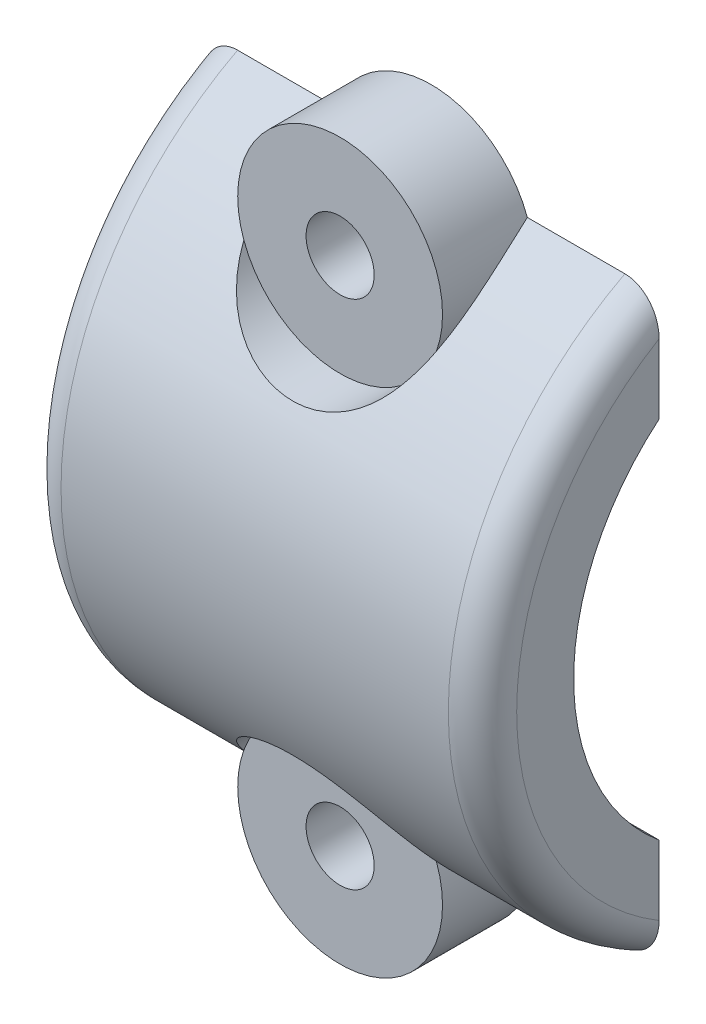
ISO-10303-21;
HEADER;
FILE_DESCRIPTION(('STEP AP214'),'2;1');
FILE_NAME('part.step','',(''),(''),'','','');
FILE_SCHEMA(('AUTOMOTIVE_DESIGN { 1 0 10303 214 1 1 1 1 }'));
ENDSEC;
DATA;
#1=APPLICATION_CONTEXT('core data for automotive mechanical design processes');
#2=APPLICATION_PROTOCOL_DEFINITION('international standard','automotive_design',2000,#1);
#3=PRODUCT_CONTEXT('',#1,'mechanical');
#4=PRODUCT('Part','Part','',(#3));
#5=PRODUCT_RELATED_PRODUCT_CATEGORY('part','',(#4));
#6=PRODUCT_DEFINITION_FORMATION('','',#4);
#7=PRODUCT_DEFINITION_CONTEXT('part definition',#1,'design');
#8=PRODUCT_DEFINITION('design','',#6,#7);
#9=PRODUCT_DEFINITION_SHAPE('','',#8);
#10=(LENGTH_UNIT() NAMED_UNIT(*) SI_UNIT(.MILLI.,.METRE.));
#11=(NAMED_UNIT(*) PLANE_ANGLE_UNIT() SI_UNIT($,.RADIAN.));
#12=(NAMED_UNIT(*) SI_UNIT($,.STERADIAN.) SOLID_ANGLE_UNIT());
#13=UNCERTAINTY_MEASURE_WITH_UNIT(LENGTH_MEASURE(1.E-05),#10,'distance_accuracy_value','');
#14=(GEOMETRIC_REPRESENTATION_CONTEXT(3) GLOBAL_UNCERTAINTY_ASSIGNED_CONTEXT((#13)) GLOBAL_UNIT_ASSIGNED_CONTEXT((#10,
#11,#12)) REPRESENTATION_CONTEXT('',''));
#15=CARTESIAN_POINT('',(0.,0.,0.));
#16=DIRECTION('',(0.,0.,1.));
#17=DIRECTION('',(1.,0.,0.));
#18=AXIS2_PLACEMENT_3D('',#15,#16,#17);
#19=CARTESIAN_POINT('',(35.8196875692033,0.,0.));
#20=DIRECTION('',(0.,0.,1.));
#21=DIRECTION('',(1.,0.,0.));
#22=AXIS2_PLACEMENT_3D('',#19,#20,#21);
#23=PLANE('',#22);
#24=CARTESIAN_POINT('',(-10.7949999999999,55.2907453999999,0.));
#25=DIRECTION('',(0.,0.,1.));
#26=DIRECTION('',(1.,0.,0.));
#27=AXIS2_PLACEMENT_3D('',#24,#25,#26);
#28=CIRCLE('',#27,1.89865);
#29=CARTESIAN_POINT('',(-8.89634999999989,55.2907453999999,0.));
#30=VERTEX_POINT('',#29);
#31=EDGE_CURVE('E191',#30,#30,#28,.T.);
#32=ORIENTED_EDGE('',*,*,#31,.T.);
#33=EDGE_LOOP('',(#32));
#34=FACE_BOUND('',#33,.T.);
#35=DIRECTION('',(-1.,0.,0.));
#36=VECTOR('',#35,1.);
#37=CARTESIAN_POINT('',(35.8196875692033,57.262527765294,0.));
#38=LINE('',#37,#36);
#39=CARTESIAN_POINT('',(1.04083408558608E-13,57.262527765294,0.));
#40=VERTEX_POINT('',#39);
#41=CARTESIAN_POINT('',(-5.43769105553762,57.262527765294,0.));
#42=VERTEX_POINT('',#41);
#43=EDGE_CURVE('E218',#40,#42,#38,.T.);
#44=ORIENTED_EDGE('',*,*,#43,.F.);
#45=CARTESIAN_POINT('',(0.,57.262527765294,0.));
#46=CARTESIAN_POINT('',(0.0490933325175248,57.2625361729945,0.));
#47=CARTESIAN_POINT('',(0.0981825549839693,57.2603879957028,0.));
#48=CARTESIAN_POINT('',(0.195977393935503,57.2518429280401,0.));
#49=CARTESIAN_POINT('',(0.244683106863623,57.2454471427635,0.));
#50=CARTESIAN_POINT('',(0.341190293861829,57.2285013083362,0.));
#51=CARTESIAN_POINT('',(0.388994359023456,57.2179660487811,0.));
#52=CARTESIAN_POINT('',(0.48352208379878,57.1928725873831,0.));
#53=CARTESIAN_POINT('',(0.530245712738035,57.1783142714739,0.));
#54=CARTESIAN_POINT('',(0.668258514115837,57.1288438188393,0.));
#55=CARTESIAN_POINT('',(0.75753119172517,57.0881108470386,0.));
#56=CARTESIAN_POINT('',(0.928324745462773,56.9928183852246,0.));
#57=CARTESIAN_POINT('',(1.00984066361444,56.9382501325223,0.));
#58=CARTESIAN_POINT('',(1.16668017679153,56.8147726046423,0.));
#59=CARTESIAN_POINT('',(1.24161160851703,56.745366120251,0.));
#60=CARTESIAN_POINT('',(1.38009979039235,56.596066634906,0.));
#61=CARTESIAN_POINT('',(1.44365503002219,56.5161722438155,0.));
#62=CARTESIAN_POINT('',(1.56484021102702,56.339198250084,0.));
#63=CARTESIAN_POINT('',(1.62111875817446,56.2411946090151,0.));
#64=CARTESIAN_POINT('',(1.71855597008335,56.0378532028676,0.));
#65=CARTESIAN_POINT('',(1.75969496105834,55.9325061048433,0.));
#66=CARTESIAN_POINT('',(1.8307416114643,55.7042443580008,0.));
#67=CARTESIAN_POINT('',(1.85872466975665,55.580732961841,0.));
#68=CARTESIAN_POINT('',(1.89584377405495,55.3312173101929,0.));
#69=CARTESIAN_POINT('',(1.90502816271561,55.2052202922972,0.));
#70=CARTESIAN_POINT('',(1.90500000000009,55.0793618565784,0.));
#71=B_SPLINE_CURVE_WITH_KNOTS('',3,(#45,#46,#47,#48,#49,#50,#51,#52,#53,#54,#55,#56,#57,#58,#59,
#60,#61,#62,#63,#64,#65,#66,#67,#68,#69,#70),.UNSPECIFIED.,.F.,.F.,(4,2,2,2,2,2,2,2,2,2,2,2,4),
(0.,0.147226065248074,0.294413841889357,0.441080456312521,0.587751229617397,0.880666747318197,
1.17376825094267,1.47891534691114,1.7841029300143,2.1217850014259,2.45990435249988,
2.83834837694025,3.21581796582278),.UNSPECIFIED.);
#72=CARTESIAN_POINT('',(1.9050000000001,55.0793618565784,0.));
#73=VERTEX_POINT('',#72);
#74=EDGE_CURVE('E273',#40,#73,#71,.T.);
#75=ORIENTED_EDGE('',*,*,#74,.T.);
#76=DIRECTION('',(0.,-1.,0.));
#77=VECTOR('',#76,1.);
#78=CARTESIAN_POINT('',(1.90500000000011,0.,0.));
#79=LINE('',#78,#77);
#80=CARTESIAN_POINT('',(1.90500000000011,51.1949953999999,0.));
#81=VERTEX_POINT('',#80);
#82=EDGE_CURVE('E201',#73,#81,#79,.T.);
#83=ORIENTED_EDGE('',*,*,#82,.T.);
#84=DIRECTION('',(-1.,0.,0.));
#85=VECTOR('',#84,1.);
#86=CARTESIAN_POINT('',(35.8196875692033,51.1949953999999,0.));
#87=LINE('',#86,#85);
#88=CARTESIAN_POINT('',(-23.4949999999999,51.1949953999999,0.));
#89=VERTEX_POINT('',#88);
#90=EDGE_CURVE('E216',#81,#89,#87,.T.);
#91=ORIENTED_EDGE('',*,*,#90,.T.);
#92=DIRECTION('',(0.,1.,0.));
#93=VECTOR('',#92,1.);
#94=CARTESIAN_POINT('',(-23.4949999999999,0.,0.));
#95=LINE('',#94,#93);
#96=CARTESIAN_POINT('',(-23.4949999999999,55.0793618565784,0.));
#97=VERTEX_POINT('',#96);
#98=EDGE_CURVE('E196',#89,#97,#95,.T.);
#99=ORIENTED_EDGE('',*,*,#98,.T.);
#100=CARTESIAN_POINT('',(-23.4949999999999,55.0793618565784,0.));
#101=CARTESIAN_POINT('',(-23.4949861644648,55.1604772184922,0.));
#102=CARTESIAN_POINT('',(-23.4911935120087,55.2415428752054,0.));
#103=CARTESIAN_POINT('',(-23.4758993564817,55.4030230016933,0.));
#104=CARTESIAN_POINT('',(-23.4643900787791,55.483436731861,0.));
#105=CARTESIAN_POINT('',(-23.4179045735488,55.7234850875497,0.));
#106=CARTESIAN_POINT('',(-23.3709671738861,55.8810362336567,0.));
#107=CARTESIAN_POINT('',(-23.2540851999662,56.1611894101536,0.));
#108=CARTESIAN_POINT('',(-23.1883735777487,56.285572058831,0.));
#109=CARTESIAN_POINT('',(-23.0342107388053,56.5189428441837,0.));
#110=CARTESIAN_POINT('',(-22.9458423148961,56.6279848382293,0.));
#111=CARTESIAN_POINT('',(-22.7609682537806,56.8123805640701,0.));
#112=CARTESIAN_POINT('',(-22.6670153229301,56.8902712074076,0.));
#113=CARTESIAN_POINT('',(-22.5161948811248,56.9922345065611,0.));
#114=CARTESIAN_POINT('',(-22.4642535433482,57.0237516817825,0.));
#115=CARTESIAN_POINT('',(-22.3574771047742,57.081401166128,0.));
#116=CARTESIAN_POINT('',(-22.3026437501136,57.1075366788708,0.));
#117=CARTESIAN_POINT('',(-22.1948650223462,57.1522411313464,0.));
#118=CARTESIAN_POINT('',(-22.1420956218219,57.1712356902118,0.));
#119=CARTESIAN_POINT('',(-22.0349673128254,57.2040224484383,0.));
#120=CARTESIAN_POINT('',(-21.9806086281649,57.217815376555,0.));
#121=CARTESIAN_POINT('',(-21.8705084304921,57.2400491166256,0.));
#122=CARTESIAN_POINT('',(-21.8147611559611,57.2484614502685,0.));
#123=CARTESIAN_POINT('',(-21.7026780521917,57.2597099247138,0.));
#124=CARTESIAN_POINT('',(-21.6463419279188,57.2625431208493,0.));
#125=CARTESIAN_POINT('',(-21.5899999999999,57.262527765294,0.));
#126=B_SPLINE_CURVE_WITH_KNOTS('',3,(#100,#101,#102,#103,#104,#105,#106,#107,#108,#109,#110,
#111,#112,#113,#114,#115,#116,#117,#118,#119,#120,#121,#122,#123,#124,#125),.UNSPECIFIED.,.F.,
.F.,(4,2,2,2,2,2,2,2,2,2,2,2,4),(0.,0.243150095315534,0.486545537363687,0.975964841781668,
1.39562431400345,1.81377159016872,2.17754033950067,2.3595485588032,2.54144811625258,
2.70944622477471,2.87742078777977,3.04627720298761,3.21522271669345),.UNSPECIFIED.);
#127=CARTESIAN_POINT('',(-21.5899999999999,57.262527765294,0.));
#128=VERTEX_POINT('',#127);
#129=EDGE_CURVE('E279',#97,#128,#126,.T.);
#130=ORIENTED_EDGE('',*,*,#129,.T.);
#131=CARTESIAN_POINT('',(-16.1523089444621,57.262527765294,0.));
#132=VERTEX_POINT('',#131);
#133=EDGE_CURVE('E211',#132,#128,#38,.T.);
#134=ORIENTED_EDGE('',*,*,#133,.F.);
#135=CARTESIAN_POINT('',(-10.7949999999999,55.2907453999999,0.));
#136=DIRECTION('',(0.,0.,1.));
#137=DIRECTION('',(1.,0.,0.));
#138=AXIS2_PLACEMENT_3D('',#135,#136,#137);
#139=CIRCLE('',#138,5.70865);
#140=EDGE_CURVE('E187',#42,#132,#139,.T.);
#141=ORIENTED_EDGE('',*,*,#140,.F.);
#142=EDGE_LOOP('',(#44,#75,#83,#91,#99,#130,#134,#141));
#143=FACE_BOUND('',#142,.T.);
#144=ADVANCED_FACE('F35',(#34,#143),#23,.F.);
#145=CARTESIAN_POINT('',(35.8196875692033,0.,0.));
#146=DIRECTION('',(0.,0.,-1.));
#147=DIRECTION('',(-1.,0.,0.));
#148=AXIS2_PLACEMENT_3D('',#145,#146,#147);
#149=PLANE('',#148);
#150=CARTESIAN_POINT('',(-10.7949999999999,26.7792453999999,0.));
#151=DIRECTION('',(0.,0.,-1.));
#152=DIRECTION('',(-1.,0.,0.));
#153=AXIS2_PLACEMENT_3D('',#150,#151,#152);
#154=CIRCLE('',#153,1.89865);
#155=CARTESIAN_POINT('',(-12.6936499999999,26.7792453999999,0.));
#156=VERTEX_POINT('',#155);
#157=EDGE_CURVE('E143',#156,#156,#154,.F.);
#158=ORIENTED_EDGE('',*,*,#157,.T.);
#159=EDGE_LOOP('',(#158));
#160=FACE_BOUND('',#159,.T.);
#161=DIRECTION('',(0.,1.,0.));
#162=VECTOR('',#161,1.);
#163=CARTESIAN_POINT('',(1.90500000000011,0.,0.));
#164=LINE('',#163,#162);
#165=CARTESIAN_POINT('',(1.90500000000011,26.9906289434214,0.));
#166=VERTEX_POINT('',#165);
#167=CARTESIAN_POINT('',(1.9050000000001,30.8749953999999,0.));
#168=VERTEX_POINT('',#167);
#169=EDGE_CURVE('E200',#166,#168,#164,.T.);
#170=ORIENTED_EDGE('',*,*,#169,.F.);
#171=CARTESIAN_POINT('',(1.9050000000001,26.9906289434214,0.));
#172=CARTESIAN_POINT('',(1.90498616446498,26.9095135815077,0.));
#173=CARTESIAN_POINT('',(1.90119351200893,26.8284479247944,0.));
#174=CARTESIAN_POINT('',(1.88589935648186,26.6669677983066,0.));
#175=CARTESIAN_POINT('',(1.87439007877933,26.5865540681388,0.));
#176=CARTESIAN_POINT('',(1.82790457354895,26.3465057124501,0.));
#177=CARTESIAN_POINT('',(1.7809671738863,26.1889545663432,0.));
#178=CARTESIAN_POINT('',(1.6640851999664,25.9088013898462,0.));
#179=CARTESIAN_POINT('',(1.59837357774884,25.7844187411689,0.));
#180=CARTESIAN_POINT('',(1.44421073880548,25.5510479558161,0.));
#181=CARTESIAN_POINT('',(1.35584231489629,25.4420059617705,0.));
#182=CARTESIAN_POINT('',(1.17096825378082,25.2576102359297,0.));
#183=CARTESIAN_POINT('',(1.07701532293032,25.1797195925923,0.));
#184=CARTESIAN_POINT('',(0.926194881124996,25.0777562934388,0.));
#185=CARTESIAN_POINT('',(0.874253543348375,25.0462391182174,0.));
#186=CARTESIAN_POINT('',(0.767477104774417,24.9885896338718,0.));
#187=CARTESIAN_POINT('',(0.712643750113809,24.962454121129,0.));
#188=CARTESIAN_POINT('',(0.604865022346436,24.9177496686535,0.));
#189=CARTESIAN_POINT('',(0.552095621822044,24.8987551097881,0.));
#190=CARTESIAN_POINT('',(0.44496731282555,24.8659683515616,0.));
#191=CARTESIAN_POINT('',(0.390608628165044,24.8521754234448,0.));
#192=CARTESIAN_POINT('',(0.280508430492258,24.8299416833742,0.));
#193=CARTESIAN_POINT('',(0.224761155961284,24.8215293497314,0.));
#194=CARTESIAN_POINT('',(0.112678052191859,24.8102808752861,0.));
#195=CARTESIAN_POINT('',(0.0563419279189433,24.8074476791505,0.));
#196=CARTESIAN_POINT('',(0.,24.8074630347058,0.));
#197=B_SPLINE_CURVE_WITH_KNOTS('',3,(#171,#172,#173,#174,#175,#176,#177,#178,#179,#180,#181,
#182,#183,#184,#185,#186,#187,#188,#189,#190,#191,#192,#193,#194,#195,#196),.UNSPECIFIED.,.F.,
.F.,(4,2,2,2,2,2,2,2,2,2,2,2,4),(0.,0.243150095315531,0.48654553736369,0.975964841781664,
1.39562431400345,1.81377159016872,2.17754033950067,2.35954855880319,2.54144811625258,
2.70944622477471,2.87742078777977,3.04627720298761,3.21522271669345),.UNSPECIFIED.);
#198=CARTESIAN_POINT('',(1.11022302462516E-13,24.8074630347058,0.));
#199=VERTEX_POINT('',#198);
#200=EDGE_CURVE('E44',#166,#199,#197,.T.);
#201=ORIENTED_EDGE('',*,*,#200,.T.);
#202=DIRECTION('',(-1.,0.,0.));
#203=VECTOR('',#202,1.);
#204=CARTESIAN_POINT('',(35.8196875692033,24.8074630347059,0.));
#205=LINE('',#204,#203);
#206=CARTESIAN_POINT('',(-5.43769105553762,24.8074630347058,0.));
#207=VERTEX_POINT('',#206);
#208=EDGE_CURVE('E212',#199,#207,#205,.T.);
#209=ORIENTED_EDGE('',*,*,#208,.T.);
#210=CARTESIAN_POINT('',(-10.7949999999999,26.7792453999999,0.));
#211=DIRECTION('',(0.,0.,-1.));
#212=DIRECTION('',(1.,0.,0.));
#213=AXIS2_PLACEMENT_3D('',#210,#211,#212);
#214=CIRCLE('',#213,5.70865);
#215=CARTESIAN_POINT('',(-16.1523089444621,24.8074630347058,0.));
#216=VERTEX_POINT('',#215);
#217=EDGE_CURVE('E136',#207,#216,#214,.T.);
#218=ORIENTED_EDGE('',*,*,#217,.T.);
#219=CARTESIAN_POINT('',(-21.5899999999999,24.8074630347058,0.));
#220=VERTEX_POINT('',#219);
#221=EDGE_CURVE('E141',#216,#220,#205,.T.);
#222=ORIENTED_EDGE('',*,*,#221,.T.);
#223=CARTESIAN_POINT('',(-21.5899999999999,24.8074630347058,0.));
#224=CARTESIAN_POINT('',(-21.6390933325173,24.8074546270054,0.));
#225=CARTESIAN_POINT('',(-21.6881825549838,24.8096028042971,0.));
#226=CARTESIAN_POINT('',(-21.7859773939353,24.8181478719597,0.));
#227=CARTESIAN_POINT('',(-21.8346831068634,24.8245436572363,0.));
#228=CARTESIAN_POINT('',(-21.9311902938616,24.8414894916637,0.));
#229=CARTESIAN_POINT('',(-21.9789943590233,24.8520247512187,0.));
#230=CARTESIAN_POINT('',(-22.0735220837986,24.8771182126168,0.));
#231=CARTESIAN_POINT('',(-22.1202457127379,24.8916765285259,0.));
#232=CARTESIAN_POINT('',(-22.2582585141156,24.9411469811605,0.));
#233=CARTESIAN_POINT('',(-22.347531191725,24.9818799529612,0.));
#234=CARTESIAN_POINT('',(-22.5183247454626,25.0771724147753,0.));
#235=CARTESIAN_POINT('',(-22.5998406636143,25.1317406674775,0.));
#236=CARTESIAN_POINT('',(-22.7566801767913,25.2552181953575,0.));
#237=CARTESIAN_POINT('',(-22.8316116085168,25.3246246797488,0.));
#238=CARTESIAN_POINT('',(-22.9700997903922,25.4739241650939,0.));
#239=CARTESIAN_POINT('',(-23.033655030022,25.5538185561844,0.));
#240=CARTESIAN_POINT('',(-23.1548402110268,25.7307925499159,0.));
#241=CARTESIAN_POINT('',(-23.2111187581743,25.8287961909847,0.));
#242=CARTESIAN_POINT('',(-23.3085559700832,26.0321375971322,0.));
#243=CARTESIAN_POINT('',(-23.3496949610582,26.1374846951565,0.));
#244=CARTESIAN_POINT('',(-23.4207416114641,26.3657464419991,0.));
#245=CARTESIAN_POINT('',(-23.4487246697565,26.4892578381589,0.));
#246=CARTESIAN_POINT('',(-23.4858437740548,26.738773489807,0.));
#247=CARTESIAN_POINT('',(-23.4950281627154,26.8647705077027,0.));
#248=CARTESIAN_POINT('',(-23.4949999999999,26.9906289434214,0.));
#249=B_SPLINE_CURVE_WITH_KNOTS('',3,(#223,#224,#225,#226,#227,#228,#229,#230,#231,#232,#233,
#234,#235,#236,#237,#238,#239,#240,#241,#242,#243,#244,#245,#246,#247,#248),.UNSPECIFIED.,.F.,
.F.,(4,2,2,2,2,2,2,2,2,2,2,2,4),(0.,0.147226065248073,0.294413841889356,0.441080456312521,
0.587751229617397,0.880666747318196,1.17376825094268,1.47891534691114,1.78410293001431,
2.12178500142591,2.45990435249989,2.83834837694026,3.21581796582278),.UNSPECIFIED.);
#250=CARTESIAN_POINT('',(-23.4949999999999,26.9906289434214,0.));
#251=VERTEX_POINT('',#250);
#252=EDGE_CURVE('E51',#220,#251,#249,.T.);
#253=ORIENTED_EDGE('',*,*,#252,.T.);
#254=DIRECTION('',(0.,-1.,0.));
#255=VECTOR('',#254,1.);
#256=CARTESIAN_POINT('',(-23.4949999999999,0.,0.));
#257=LINE('',#256,#255);
#258=CARTESIAN_POINT('',(-23.4949999999999,30.8749953999999,0.));
#259=VERTEX_POINT('',#258);
#260=EDGE_CURVE('E209',#259,#251,#257,.T.);
#261=ORIENTED_EDGE('',*,*,#260,.F.);
#262=DIRECTION('',(-1.,0.,0.));
#263=VECTOR('',#262,1.);
#264=CARTESIAN_POINT('',(35.8196875692033,30.8749953999999,0.));
#265=LINE('',#264,#263);
#266=EDGE_CURVE('E214',#168,#259,#265,.T.);
#267=ORIENTED_EDGE('',*,*,#266,.F.);
#268=EDGE_LOOP('',(#170,#201,#209,#218,#222,#253,#261,#267));
#269=FACE_BOUND('',#268,.T.);
#270=ADVANCED_FACE('F251',(#160,#269),#149,.T.);
#271=CARTESIAN_POINT('',(35.8196875692033,41.0349953999999,-8.45608333333334));
#272=DIRECTION('',(-1.,0.,0.));
#273=DIRECTION('',(0.,-1.,0.));
#274=AXIS2_PLACEMENT_3D('',#271,#272,#273);
#275=CYLINDRICAL_SURFACE('',#274,18.2985833333333);
#276=ORIENTED_EDGE('',*,*,#208,.F.);
#277=CARTESIAN_POINT('',(0.,41.0349953999999,-8.45608333333334));
#278=DIRECTION('',(-1.,0.,0.));
#279=DIRECTION('',(0.,-1.,0.));
#280=AXIS2_PLACEMENT_3D('',#277,#278,#279);
#281=CIRCLE('',#280,18.2985833333333);
#282=EDGE_CURVE('E302',#199,#40,#281,.T.);
#283=ORIENTED_EDGE('',*,*,#282,.T.);
#284=ORIENTED_EDGE('',*,*,#43,.T.);
#285=CARTESIAN_POINT('',(-5.42705603913339,53.3481022378374,5.08));
#286=CARTESIAN_POINT('',(-5.39545530870201,53.4354259489317,5.0005689802008));
#287=CARTESIAN_POINT('',(-5.36636738368394,53.5224566313771,4.91985377745813));
#288=CARTESIAN_POINT('',(-5.3129700470884,53.6956754916432,4.75601438420526));
#289=CARTESIAN_POINT('',(-5.28865953873438,53.7818638585109,4.67289075165079));
#290=CARTESIAN_POINT('',(-5.22257690042593,54.0385567190107,4.42037020418626));
#291=CARTESIAN_POINT('',(-5.18755048950347,54.2074803456216,4.24755907668908));
#292=CARTESIAN_POINT('',(-5.13396234516217,54.5366362448042,3.89708244503129));
#293=CARTESIAN_POINT('',(-5.11513138388365,54.696967345291,3.71954902225021));
#294=CARTESIAN_POINT('',(-5.09103323485701,55.0110068137217,3.35775041373031));
#295=CARTESIAN_POINT('',(-5.0857712218314,55.1647126330487,3.17348268692457));
#296=CARTESIAN_POINT('',(-5.0871769788107,55.4999005560824,2.7551767137304));
#297=CARTESIAN_POINT('',(-5.0969311185005,55.6794454891102,2.51959887557127));
#298=CARTESIAN_POINT('',(-5.1312699527197,56.0264404336525,2.04068956522794));
#299=CARTESIAN_POINT('',(-5.15585997748074,56.1938860739145,1.79735533610562));
#300=CARTESIAN_POINT('',(-5.2176783125778,56.5196787794888,1.29857682939293));
#301=CARTESIAN_POINT('',(-5.25517147526792,56.677746465679,1.04298406394059));
#302=CARTESIAN_POINT('',(-5.3398518099322,56.9803051663188,0.525840067634314));
#303=CARTESIAN_POINT('',(-5.38702755733803,57.1248118912897,0.264296179016649));
#304=CARTESIAN_POINT('',(-5.43769105553763,57.262527765294,0.));
#305=B_SPLINE_CURVE_WITH_KNOTS('',3,(#285,#286,#287,#288,#289,#290,#291,#292,#293,#294,#295,
#296,#297,#298,#299,#300,#301,#302,#303,#304),.UNSPECIFIED.,.F.,.F.,(4,2,2,2,2,2,2,2,2,4),(0.,
0.36653084617378,0.732977447386735,1.46465420680641,2.18391875970653,2.90345757442333,
3.79170206100217,4.68026586594892,5.58827903657794,6.49522693069335),.UNSPECIFIED.);
#306=CARTESIAN_POINT('',(-5.42705603913338,53.3481022378374,5.08));
#307=VERTEX_POINT('',#306);
#308=EDGE_CURVE('E227',#307,#42,#305,.T.);
#309=ORIENTED_EDGE('',*,*,#308,.F.);
#310=CARTESIAN_POINT('',(-16.1629439608664,53.3481022378374,5.08));
#311=CARTESIAN_POINT('',(-16.1144776277,53.2141551173137,5.20188077947436));
#312=CARTESIAN_POINT('',(-16.060059969339,53.0794834363106,5.32071581463812));
#313=CARTESIAN_POINT('',(-15.9385382957055,52.8099053363963,5.55180552578658));
#314=CARTESIAN_POINT('',(-15.8714183928283,52.6749988354302,5.66405172778317));
#315=CARTESIAN_POINT('',(-15.7234900752845,52.4058968777153,5.88166037947822));
#316=CARTESIAN_POINT('',(-15.6426205647009,52.2717074792091,5.98698906173924));
#317=CARTESIAN_POINT('',(-15.4669628726233,52.0064294120101,6.18951655578182));
#318=CARTESIAN_POINT('',(-15.3721819862178,51.8753391597137,6.28671958695457));
#319=CARTESIAN_POINT('',(-15.1840710276905,51.6377943297606,6.45823466098499));
#320=CARTESIAN_POINT('',(-15.0927396860816,51.5306402979274,6.53377310659307));
#321=CARTESIAN_POINT('',(-14.8999925587466,51.3211137591381,6.6783182916377));
#322=CARTESIAN_POINT('',(-14.7985784260376,51.2187404724369,6.74732609812695));
#323=CARTESIAN_POINT('',(-14.5861327224854,51.0202556463412,6.87841535806306));
#324=CARTESIAN_POINT('',(-14.4751226087975,50.9241309375499,6.94051158905271));
#325=CARTESIAN_POINT('',(-14.24373897844,50.7391721676174,7.0577523614931));
#326=CARTESIAN_POINT('',(-14.123365559526,50.6503380303805,7.11289697550498));
#327=CARTESIAN_POINT('',(-13.8732597849653,50.480761689975,7.21636294281489));
#328=CARTESIAN_POINT('',(-13.7434828606248,50.4000630319765,7.26464809130114));
#329=CARTESIAN_POINT('',(-13.4759566760506,50.2484448427949,7.3539846504218));
#330=CARTESIAN_POINT('',(-13.3382072136525,50.1775255597479,7.39503587751435));
#331=CARTESIAN_POINT('',(-13.0556719486023,50.0464807824744,7.46990128433761));
#332=CARTESIAN_POINT('',(-12.9108820721856,49.9863616342364,7.50371121142286));
#333=CARTESIAN_POINT('',(-12.6155073792229,49.8778731094074,7.56407663257656));
#334=CARTESIAN_POINT('',(-12.4649230043264,49.8295028393778,7.59063267828252));
#335=CARTESIAN_POINT('',(-12.1716632254696,49.7486604415912,7.63466352842613));
#336=CARTESIAN_POINT('',(-12.0293392259082,49.7152159498474,7.65270084818223));
#337=CARTESIAN_POINT('',(-11.7419272169366,49.659276322646,7.68271901227355));
#338=CARTESIAN_POINT('',(-11.5968393026862,49.6367808109268,7.69470006473279));
#339=CARTESIAN_POINT('',(-11.3050543992462,49.6030313563692,7.71262958805476));
#340=CARTESIAN_POINT('',(-11.1583581008536,49.5917727648525,7.71858055356084));
#341=CARTESIAN_POINT('',(-10.8644132468465,49.5806230556744,7.72447415968274));
#342=CARTESIAN_POINT('',(-10.7171646963437,49.5807318330521,7.72441685577606));
#343=CARTESIAN_POINT('',(-10.4280092202547,49.592126637427,7.71839330786506));
#344=CARTESIAN_POINT('',(-10.2860838436868,49.603050295472,7.71261863281835));
#345=CARTESIAN_POINT('',(-10.0037334398526,49.6354133867135,7.69542736881159));
#346=CARTESIAN_POINT('',(-9.86330892929829,49.6568563293965,7.68400889693543));
#347=CARTESIAN_POINT('',(-9.58505908737643,49.7099944076745,7.65551035119475));
#348=CARTESIAN_POINT('',(-9.447232716981,49.7416853487928,7.63843259358905));
#349=CARTESIAN_POINT('',(-9.17502413269327,49.8149589721661,7.59857734922603));
#350=CARTESIAN_POINT('',(-9.0406432128869,49.8565453124747,7.57579775449624));
#351=CARTESIAN_POINT('',(-8.77603434871534,49.9491959945387,7.52446694511954));
#352=CARTESIAN_POINT('',(-8.64581468018277,50.0002779945118,7.49590496853885));
#353=CARTESIAN_POINT('',(-8.39058814586037,50.1112800420847,7.43300968558085));
#354=CARTESIAN_POINT('',(-8.26558317428471,50.1712032659699,7.39867430443672));
#355=CARTESIAN_POINT('',(-8.02164498147327,50.2991377447465,7.32426168646357));
#356=CARTESIAN_POINT('',(-7.90270911712127,50.3671454351105,7.2841869785808));
#357=CARTESIAN_POINT('',(-7.67146143797609,50.5105040953904,7.19830483523897));
#358=CARTESIAN_POINT('',(-7.55915210930689,50.5858577935907,7.15249526806239));
#359=CARTESIAN_POINT('',(-7.33793907242254,50.7457825876605,7.05352364123881));
#360=CARTESIAN_POINT('',(-7.22929185717979,50.8305838851837,7.00016046513959));
#361=CARTESIAN_POINT('',(-7.02014267453747,51.0061463176596,6.88748815031349));
#362=CARTESIAN_POINT('',(-6.91964371681487,51.0969096325646,6.8281768324855));
#363=CARTESIAN_POINT('',(-6.72712941324598,51.2833686838082,6.7037828494735));
#364=CARTESIAN_POINT('',(-6.63511508173966,51.3790650077633,6.63869949606056));
#365=CARTESIAN_POINT('',(-6.45972558710788,51.5743849398814,6.50298121311786));
#366=CARTESIAN_POINT('',(-6.37635346300472,51.6740099126637,6.4323443459524));
#367=CARTESIAN_POINT('',(-6.1246244530743,51.996083362462,6.19884217808298));
#368=CARTESIAN_POINT('',(-5.97261550244413,52.2242002681517,6.02586399224044));
#369=CARTESIAN_POINT('',(-5.70877041815053,52.6850682039674,5.65777328795732));
#370=CARTESIAN_POINT('',(-5.59690511492412,52.9178157390161,5.46267697740414));
#371=CARTESIAN_POINT('',(-5.48981291972514,53.182437671053,5.2289372051622));
#372=CARTESIAN_POINT('',(-5.4767424643482,53.2156347002712,5.19939812471849));
#373=CARTESIAN_POINT('',(-5.45134817268442,53.2819329820497,5.13996903173544));
#374=CARTESIAN_POINT('',(-5.43902357420971,53.3150342983058,5.11007941602383));
#375=CARTESIAN_POINT('',(-5.42705603913338,53.3481022378374,5.08000000000001));
#376=B_SPLINE_CURVE_WITH_KNOTS('',3,(#310,#311,#312,#313,#314,#315,#316,#317,#318,#319,#320,
#321,#322,#323,#324,#325,#326,#327,#328,#329,#330,#331,#332,#333,#334,#335,#336,#337,#338,#339,
#340,#341,#342,#343,#344,#345,#346,#347,#348,#349,#350,#351,#352,#353,#354,#355,#356,#357,#358,
#359,#360,#361,#362,#363,#364,#365,#366,#367,#368,#369,#370,#371,#372,#373,#374,#375),
.UNSPECIFIED.,.F.,.F.,(4,2,2,2,2,2,2,2,2,2,2,2,2,2,2,2,2,2,2,2,2,2,2,2,2,2,2,2,2,2,2,2,4),(0.,
0.562411300002662,1.12553075372058,1.69122113144262,2.25661591553875,2.73546469009004,
3.21423508911827,3.69196133178753,4.16968258752687,4.64983840217154,5.13000639776188,
5.61045561617461,6.09086828758127,6.53224986264878,6.97361626857873,7.41480000685227,
7.85597967144619,8.28286070187543,8.70988424704894,9.13673323345365,9.56374025986022,
9.99154944371265,10.4195126976191,10.8472879529871,11.2752226924401,11.7181244091465,
12.1611889797304,12.6043064503481,13.0475792178466,14.0160579992688,14.9838316235478,
15.122788245078,15.2616003824265),.UNSPECIFIED.);
#377=CARTESIAN_POINT('',(-16.1629439608664,53.3481022378374,5.08));
#378=VERTEX_POINT('',#377);
#379=EDGE_CURVE('E177',#378,#307,#376,.T.);
#380=ORIENTED_EDGE('',*,*,#379,.F.);
#381=CARTESIAN_POINT('',(-16.1523089444621,57.262527765294,0.));
#382=CARTESIAN_POINT('',(-16.1873483815023,57.1673110897216,0.182717919277055));
#383=CARTESIAN_POINT('',(-16.2206968210075,57.0688870521497,0.364070893642255));
#384=CARTESIAN_POINT('',(-16.2831568075119,56.865593202056,0.723954657810232));
#385=CARTESIAN_POINT('',(-16.3122668244953,56.760721081194,0.902484407837411));
#386=CARTESIAN_POINT('',(-16.3921728188261,56.4354610672232,1.43519324258572));
#387=CARTESIAN_POINT('',(-16.435193473613,56.2053382184385,1.78474460445658));
#388=CARTESIAN_POINT('',(-16.4917441800784,55.7284271824323,2.45746801417564));
#389=CARTESIAN_POINT('',(-16.506204836948,55.4824446596232,2.78113043863504));
#390=CARTESIAN_POINT('',(-16.5003651273332,54.9699323182724,3.4106585347216));
#391=CARTESIAN_POINT('',(-16.4801527765968,54.7034561612555,3.71656723629048));
#392=CARTESIAN_POINT('',(-16.4249417674019,54.3419791742281,4.10491599989864));
#393=CARTESIAN_POINT('',(-16.4094949597414,54.2542777703635,4.19717214982741));
#394=CARTESIAN_POINT('',(-16.3739497043375,54.0774272970658,4.37938362631489));
#395=CARTESIAN_POINT('',(-16.3538514820036,53.9882782979783,4.46933906413253));
#396=CARTESIAN_POINT('',(-16.3084759078969,53.8078388508157,4.64769004528467));
#397=CARTESIAN_POINT('',(-16.2831470605113,53.716535785843,4.73605977541218));
#398=CARTESIAN_POINT('',(-16.2271356499856,53.5329638959115,4.91010446411686));
#399=CARTESIAN_POINT('',(-16.1964516923968,53.4406948253059,4.9957787139268));
#400=CARTESIAN_POINT('',(-16.1629439608664,53.3481022378374,5.08));
#401=B_SPLINE_CURVE_WITH_KNOTS('',3,(#381,#382,#383,#384,#385,#386,#387,#388,#389,#390,#391,
#392,#393,#394,#395,#396,#397,#398,#399,#400),.UNSPECIFIED.,.F.,.F.,(4,2,2,2,2,2,2,2,2,4),(0.,
0.626914061553586,1.2540538728506,2.51431778781222,3.73279127165471,4.94817629470758,
5.33276657038938,5.71733821257394,6.1058937719879,6.49455066104908),.UNSPECIFIED.);
#402=EDGE_CURVE('E203',#132,#378,#401,.T.);
#403=ORIENTED_EDGE('',*,*,#402,.F.);
#404=ORIENTED_EDGE('',*,*,#133,.T.);
#405=CARTESIAN_POINT('',(-21.5899999999999,41.0349953999999,-8.45608333333334));
#406=DIRECTION('',(-1.,0.,0.));
#407=DIRECTION('',(0.,-1.,0.));
#408=AXIS2_PLACEMENT_3D('',#405,#406,#407);
#409=CIRCLE('',#408,18.2985833333333);
#410=EDGE_CURVE('E303',#128,#220,#409,.F.);
#411=ORIENTED_EDGE('',*,*,#410,.T.);
#412=ORIENTED_EDGE('',*,*,#221,.F.);
#413=CARTESIAN_POINT('',(-16.1523089444621,24.8074630347058,0.));
#414=CARTESIAN_POINT('',(-16.1873483815023,24.9026797102782,0.182717919277056));
#415=CARTESIAN_POINT('',(-16.2206968210075,25.0011037478501,0.364070893642256));
#416=CARTESIAN_POINT('',(-16.2831568075119,25.2043975979438,0.723954657810232));
#417=CARTESIAN_POINT('',(-16.3122668244953,25.3092697188059,0.902484407837411));
#418=CARTESIAN_POINT('',(-16.3921728188261,25.6345297327766,1.43519324258572));
#419=CARTESIAN_POINT('',(-16.435193473613,25.8646525815613,1.78474460445658));
#420=CARTESIAN_POINT('',(-16.4917441800784,26.3415636175675,2.45746801417565));
#421=CARTESIAN_POINT('',(-16.506204836948,26.5875461403766,2.78113043863505));
#422=CARTESIAN_POINT('',(-16.5003651273332,27.1000584817275,3.4106585347216));
#423=CARTESIAN_POINT('',(-16.4801527765968,27.3665346387444,3.71656723629049));
#424=CARTESIAN_POINT('',(-16.4249417674019,27.7280116257717,4.10491599989865));
#425=CARTESIAN_POINT('',(-16.4094949597414,27.8157130296363,4.19717214982742));
#426=CARTESIAN_POINT('',(-16.3739497043375,27.992563502934,4.3793836263149));
#427=CARTESIAN_POINT('',(-16.3538514820036,28.0817125020216,4.46933906413253));
#428=CARTESIAN_POINT('',(-16.3084759078969,28.2621519491842,4.64769004528467));
#429=CARTESIAN_POINT('',(-16.2831470605113,28.3534550141568,4.73605977541219));
#430=CARTESIAN_POINT('',(-16.2271356499856,28.5370269040883,4.91010446411687));
#431=CARTESIAN_POINT('',(-16.1964516923968,28.6292959746939,4.99577871392681));
#432=CARTESIAN_POINT('',(-16.1629439608664,28.7218885621624,5.08));
#433=B_SPLINE_CURVE_WITH_KNOTS('',3,(#413,#414,#415,#416,#417,#418,#419,#420,#421,#422,#423,
#424,#425,#426,#427,#428,#429,#430,#431,#432),.UNSPECIFIED.,.F.,.F.,(4,2,2,2,2,2,2,2,2,4),(0.,
0.626914061553588,1.2540538728506,2.51431778781222,3.73279127165472,4.94817629470759,
5.33276657038939,5.71733821257395,6.1058937719879,6.49455066104908),.UNSPECIFIED.);
#434=CARTESIAN_POINT('',(-16.1629439608664,28.7218885621624,5.08));
#435=VERTEX_POINT('',#434);
#436=EDGE_CURVE('E133',#216,#435,#433,.T.);
#437=ORIENTED_EDGE('',*,*,#436,.T.);
#438=CARTESIAN_POINT('',(-5.42705603913338,28.7218885621624,5.08));
#439=CARTESIAN_POINT('',(-5.47552237229975,28.8558356826861,5.20188077947436));
#440=CARTESIAN_POINT('',(-5.52994003066081,28.9905073636893,5.32071581463812));
#441=CARTESIAN_POINT('',(-5.65146170429422,29.2600854636035,5.55180552578658));
#442=CARTESIAN_POINT('',(-5.71858160717148,29.3949919645696,5.66405172778317));
#443=CARTESIAN_POINT('',(-5.86650992471529,29.6640939222845,5.88166037947822));
#444=CARTESIAN_POINT('',(-5.94737943529887,29.7982833207907,5.98698906173924));
#445=CARTESIAN_POINT('',(-6.12303712737648,30.0635613879897,6.18951655578182));
#446=CARTESIAN_POINT('',(-6.21781801378198,30.1946516402861,6.28671958695457));
#447=CARTESIAN_POINT('',(-6.40592897230928,30.4321964702392,6.45823466098499));
#448=CARTESIAN_POINT('',(-6.49726031391816,30.5393505020724,6.53377310659306));
#449=CARTESIAN_POINT('',(-6.69000744125311,30.7488770408618,6.6783182916377));
#450=CARTESIAN_POINT('',(-6.79142157396214,30.851250327563,6.74732609812695));
#451=CARTESIAN_POINT('',(-7.00386727751438,31.0497351536586,6.87841535806306));
#452=CARTESIAN_POINT('',(-7.11487739120224,31.1458598624499,6.9405115890527));
#453=CARTESIAN_POINT('',(-7.34626102155973,31.3308186323824,7.0577523614931));
#454=CARTESIAN_POINT('',(-7.46663444047377,31.4196527696193,7.11289697550498));
#455=CARTESIAN_POINT('',(-7.71674021503445,31.5892291100248,7.21636294281488));
#456=CARTESIAN_POINT('',(-7.84651713937499,31.6699277680233,7.26464809130113));
#457=CARTESIAN_POINT('',(-8.11404332394912,31.8215459572049,7.35398465042179));
#458=CARTESIAN_POINT('',(-8.25179278634727,31.8924652402519,7.39503587751435));
#459=CARTESIAN_POINT('',(-8.53432805139746,32.0235100175254,7.46990128433761));
#460=CARTESIAN_POINT('',(-8.6791179278141,32.0836291657634,7.50371121142286));
#461=CARTESIAN_POINT('',(-8.9744926207769,32.1921176905925,7.56407663257656));
#462=CARTESIAN_POINT('',(-9.12507699567337,32.240487960622,7.59063267828252));
#463=CARTESIAN_POINT('',(-9.41833677453016,32.3213303584087,7.63466352842613));
#464=CARTESIAN_POINT('',(-9.56066077409151,32.3547748501524,7.65270084818223));
#465=CARTESIAN_POINT('',(-9.84807278306317,32.4107144773539,7.68271901227356));
#466=CARTESIAN_POINT('',(-9.99316069731354,32.433209989073,7.69470006473279));
#467=CARTESIAN_POINT('',(-10.2849456007536,32.4669594436306,7.71262958805476));
#468=CARTESIAN_POINT('',(-10.4316418991461,32.4782180351473,7.71858055356084));
#469=CARTESIAN_POINT('',(-10.7255867531532,32.4893677443254,7.72447415968274));
#470=CARTESIAN_POINT('',(-10.872835303656,32.4892589669477,7.72441685577606));
#471=CARTESIAN_POINT('',(-11.1619907797451,32.4778641625729,7.71839330786506));
#472=CARTESIAN_POINT('',(-11.303916156313,32.4669405045278,7.71261863281835));
#473=CARTESIAN_POINT('',(-11.5862665601471,32.4345774132863,7.69542736881159));
#474=CARTESIAN_POINT('',(-11.7266910707015,32.4131344706033,7.68400889693544));
#475=CARTESIAN_POINT('',(-12.0049409126233,32.3599963923254,7.65551035119476));
#476=CARTESIAN_POINT('',(-12.1427672830187,32.3283054512071,7.63843259358905));
#477=CARTESIAN_POINT('',(-12.4149758673065,32.2550318278337,7.59857734922604));
#478=CARTESIAN_POINT('',(-12.5493567871128,32.2134454875252,7.57579775449625));
#479=CARTESIAN_POINT('',(-12.8139656512844,32.1207948054611,7.52446694511954));
#480=CARTESIAN_POINT('',(-12.944185319817,32.069712805488,7.49590496853886));
#481=CARTESIAN_POINT('',(-13.1994118541394,31.9587107579152,7.43300968558085));
#482=CARTESIAN_POINT('',(-13.324416825715,31.89878753403,7.39867430443673));
#483=CARTESIAN_POINT('',(-13.5683550185265,31.7708530552533,7.32426168646357));
#484=CARTESIAN_POINT('',(-13.6872908828785,31.7028453648894,7.28418697858081));
#485=CARTESIAN_POINT('',(-13.9185385620237,31.5594867046095,7.19830483523898));
#486=CARTESIAN_POINT('',(-14.0308478906929,31.4841330064091,7.1524952680624));
#487=CARTESIAN_POINT('',(-14.2520609275772,31.3242082123394,7.05352364123883));
#488=CARTESIAN_POINT('',(-14.36070814282,31.2394069148161,7.0001604651396));
#489=CARTESIAN_POINT('',(-14.5698573254623,31.0638444823403,6.88748815031351));
#490=CARTESIAN_POINT('',(-14.6703562831849,30.9730811674353,6.82817683248551));
#491=CARTESIAN_POINT('',(-14.8628705867538,30.7866221161916,6.70378284947351));
#492=CARTESIAN_POINT('',(-14.9548849182601,30.6909257922366,6.63869949606058));
#493=CARTESIAN_POINT('',(-15.1302744128919,30.4956058601185,6.50298121311787));
#494=CARTESIAN_POINT('',(-15.213646536995,30.3959808873362,6.43234434595241));
#495=CARTESIAN_POINT('',(-15.4653755469255,30.0739074375379,6.19884217808299));
#496=CARTESIAN_POINT('',(-15.6173844975556,29.8457905318482,6.02586399224045));
#497=CARTESIAN_POINT('',(-15.8812295818492,29.3849225960325,5.65777328795733));
#498=CARTESIAN_POINT('',(-15.9930948850757,29.1521750609838,5.46267697740414));
#499=CARTESIAN_POINT('',(-16.1001870802746,28.8875531289468,5.22893720516221));
#500=CARTESIAN_POINT('',(-16.1132575356516,28.8543560997286,5.1993981247185));
#501=CARTESIAN_POINT('',(-16.1386518273154,28.7880578179502,5.13996903173545));
#502=CARTESIAN_POINT('',(-16.1509764257901,28.754956501694,5.11007941602384));
#503=CARTESIAN_POINT('',(-16.1629439608664,28.7218885621624,5.08));
#504=B_SPLINE_CURVE_WITH_KNOTS('',3,(#438,#439,#440,#441,#442,#443,#444,#445,#446,#447,#448,
#449,#450,#451,#452,#453,#454,#455,#456,#457,#458,#459,#460,#461,#462,#463,#464,#465,#466,#467,
#468,#469,#470,#471,#472,#473,#474,#475,#476,#477,#478,#479,#480,#481,#482,#483,#484,#485,#486,
#487,#488,#489,#490,#491,#492,#493,#494,#495,#496,#497,#498,#499,#500,#501,#502,#503),
.UNSPECIFIED.,.F.,.F.,(4,2,2,2,2,2,2,2,2,2,2,2,2,2,2,2,2,2,2,2,2,2,2,2,2,2,2,2,2,2,2,2,4),(0.,
0.562411300002661,1.12553075372058,1.69122113144262,2.25661591553874,2.73546469009003,
3.21423508911826,3.69196133178752,4.16968258752686,4.64983840217153,5.13000639776186,
5.6104556161746,6.09086828758126,6.53224986264877,6.97361626857871,7.41480000685226,
7.85597967144618,8.28286070187542,8.70988424704892,9.13673323345364,9.56374025986021,
9.99154944371264,10.4195126976191,10.8472879529871,11.2752226924401,11.7181244091465,
12.1611889797304,12.6043064503481,13.0475792178466,14.0160579992688,14.9838316235478,
15.122788245078,15.2616003824265),.UNSPECIFIED.);
#505=CARTESIAN_POINT('',(-5.42705603913338,28.7218885621624,5.08));
#506=VERTEX_POINT('',#505);
#507=EDGE_CURVE('E113',#506,#435,#504,.T.);
#508=ORIENTED_EDGE('',*,*,#507,.F.);
#509=CARTESIAN_POINT('',(-5.42705603913338,28.7218885621624,5.08));
#510=CARTESIAN_POINT('',(-5.395455308702,28.6345648510682,5.0005689802008));
#511=CARTESIAN_POINT('',(-5.36636738368393,28.5475341686227,4.91985377745813));
#512=CARTESIAN_POINT('',(-5.3129700470884,28.3743153083566,4.75601438420526));
#513=CARTESIAN_POINT('',(-5.28865953873438,28.288126941489,4.67289075165079));
#514=CARTESIAN_POINT('',(-5.22257690042592,28.0314340809892,4.42037020418626));
#515=CARTESIAN_POINT('',(-5.18755048950346,27.8625104543782,4.24755907668907));
#516=CARTESIAN_POINT('',(-5.13396234516216,27.5333545551956,3.89708244503128));
#517=CARTESIAN_POINT('',(-5.11513138388364,27.3730234547088,3.7195490222502));
#518=CARTESIAN_POINT('',(-5.091033234857,27.0589839862781,3.35775041373031));
#519=CARTESIAN_POINT('',(-5.08577122183139,26.9052781669511,3.17348268692456));
#520=CARTESIAN_POINT('',(-5.08717697881069,26.5700902439174,2.7551767137304));
#521=CARTESIAN_POINT('',(-5.09693111850049,26.3905453108897,2.51959887557126));
#522=CARTESIAN_POINT('',(-5.1312699527197,26.0435503663473,2.04068956522793));
#523=CARTESIAN_POINT('',(-5.15585997748073,25.8761047260854,1.79735533610561));
#524=CARTESIAN_POINT('',(-5.21767831257779,25.5503120205111,1.29857682939292));
#525=CARTESIAN_POINT('',(-5.25517147526792,25.3922443343209,1.04298406394058));
#526=CARTESIAN_POINT('',(-5.33985180993219,25.089685633681,0.525840067634311));
#527=CARTESIAN_POINT('',(-5.38702755733802,24.9451789087101,0.264296179016646));
#528=CARTESIAN_POINT('',(-5.43769105553762,24.8074630347058,0.));
#529=B_SPLINE_CURVE_WITH_KNOTS('',3,(#509,#510,#511,#512,#513,#514,#515,#516,#517,#518,#519,
#520,#521,#522,#523,#524,#525,#526,#527,#528),.UNSPECIFIED.,.F.,.F.,(4,2,2,2,2,2,2,2,2,4),(0.,
0.366530846173772,0.732977447386729,1.46465420680641,2.18391875970654,2.90345757442333,
3.79170206100217,4.68026586594892,5.58827903657795,6.49522693069335),.UNSPECIFIED.);
#530=EDGE_CURVE('E135',#506,#207,#529,.T.);
#531=ORIENTED_EDGE('',*,*,#530,.T.);
#532=EDGE_LOOP('',(#276,#283,#284,#309,#380,#403,#404,#411,#412,#437,#508,#531));
#533=FACE_BOUND('',#532,.T.);
#534=ADVANCED_FACE('F139',(#533),#275,.T.);
#535=CARTESIAN_POINT('',(35.8196875692033,41.0349953999999,-8.45608333333334));
#536=DIRECTION('',(-1.,0.,0.));
#537=DIRECTION('',(0.,-1.,0.));
#538=AXIS2_PLACEMENT_3D('',#535,#536,#537);
#539=CYLINDRICAL_SURFACE('',#538,13.2185833333333);
#540=ORIENTED_EDGE('',*,*,#266,.T.);
#541=CARTESIAN_POINT('',(-23.4949999999999,41.0349953999999,-8.45608333333334));
#542=DIRECTION('',(-1.,0.,0.));
#543=DIRECTION('',(0.,-1.,0.));
#544=AXIS2_PLACEMENT_3D('',#541,#542,#543);
#545=CIRCLE('',#544,13.2185833333333);
#546=EDGE_CURVE('E206',#89,#259,#545,.F.);
#547=ORIENTED_EDGE('',*,*,#546,.F.);
#548=ORIENTED_EDGE('',*,*,#90,.F.);
#549=CARTESIAN_POINT('',(1.9050000000001,41.0349953999999,-8.45608333333334));
#550=DIRECTION('',(-1.,0.,0.));
#551=DIRECTION('',(0.,-1.,0.));
#552=AXIS2_PLACEMENT_3D('',#549,#550,#551);
#553=CIRCLE('',#552,13.2185833333333);
#554=EDGE_CURVE('E197',#168,#81,#553,.T.);
#555=ORIENTED_EDGE('',*,*,#554,.F.);
#556=EDGE_LOOP('',(#540,#547,#548,#555));
#557=FACE_BOUND('',#556,.T.);
#558=ADVANCED_FACE('F249',(#557),#539,.F.);
#559=CARTESIAN_POINT('',(-23.4949999999999,0.,0.));
#560=DIRECTION('',(-1.,0.,0.));
#561=DIRECTION('',(0.,-1.,0.));
#562=AXIS2_PLACEMENT_3D('',#559,#560,#561);
#563=PLANE('',#562);
#564=ORIENTED_EDGE('',*,*,#260,.T.);
#565=CARTESIAN_POINT('',(-23.4949999999999,41.0349953999999,-8.45608333333334));
#566=DIRECTION('',(-1.,0.,0.));
#567=DIRECTION('',(0.,-1.,0.));
#568=AXIS2_PLACEMENT_3D('',#565,#566,#567);
#569=CIRCLE('',#568,16.3935833333333);
#570=EDGE_CURVE('E11',#251,#97,#569,.T.);
#571=ORIENTED_EDGE('',*,*,#570,.T.);
#572=ORIENTED_EDGE('',*,*,#98,.F.);
#573=ORIENTED_EDGE('',*,*,#546,.T.);
#574=EDGE_LOOP('',(#564,#571,#572,#573));
#575=FACE_BOUND('',#574,.T.);
#576=ADVANCED_FACE('F246',(#575),#563,.T.);
#577=CARTESIAN_POINT('',(1.9050000000001,41.0349953999999,0.));
#578=DIRECTION('',(-1.,0.,0.));
#579=DIRECTION('',(0.,-1.,0.));
#580=AXIS2_PLACEMENT_3D('',#577,#578,#579);
#581=PLANE('',#580);
#582=ORIENTED_EDGE('',*,*,#82,.F.);
#583=CARTESIAN_POINT('',(1.9050000000001,41.0349953999999,-8.45608333333334));
#584=DIRECTION('',(-1.,0.,0.));
#585=DIRECTION('',(0.,-1.,0.));
#586=AXIS2_PLACEMENT_3D('',#583,#584,#585);
#587=CIRCLE('',#586,16.3935833333333);
#588=EDGE_CURVE('E59',#73,#166,#587,.F.);
#589=ORIENTED_EDGE('',*,*,#588,.T.);
#590=ORIENTED_EDGE('',*,*,#169,.T.);
#591=ORIENTED_EDGE('',*,*,#554,.T.);
#592=EDGE_LOOP('',(#582,#589,#590,#591));
#593=FACE_BOUND('',#592,.T.);
#594=ADVANCED_FACE('F242',(#593),#581,.F.);
#595=CARTESIAN_POINT('',(-10.7949999999999,55.2907453999999,-1.2E-05));
#596=DIRECTION('',(0.,0.,1.));
#597=DIRECTION('',(1.,0.,0.));
#598=AXIS2_PLACEMENT_3D('',#595,#596,#597);
#599=CYLINDRICAL_SURFACE('',#598,1.89865);
#600=ORIENTED_EDGE('',*,*,#31,.F.);
#601=EDGE_LOOP('',(#600));
#602=FACE_BOUND('',#601,.T.);
#603=CARTESIAN_POINT('',(-10.7949999999999,55.2907453999999,5.08));
#604=DIRECTION('',(0.,0.,1.));
#605=DIRECTION('',(1.,0.,0.));
#606=AXIS2_PLACEMENT_3D('',#603,#604,#605);
#607=CIRCLE('',#606,1.89865);
#608=CARTESIAN_POINT('',(-8.89634999999989,55.2907453999999,5.08));
#609=VERTEX_POINT('',#608);
#610=EDGE_CURVE('E183',#609,#609,#607,.T.);
#611=ORIENTED_EDGE('',*,*,#610,.T.);
#612=EDGE_LOOP('',(#611));
#613=FACE_BOUND('',#612,.T.);
#614=ADVANCED_FACE('F237',(#602,#613),#599,.F.);
#615=CARTESIAN_POINT('',(-10.7949999999999,55.2907453999999,5.08));
#616=DIRECTION('',(0.,0.,-1.));
#617=DIRECTION('',(-1.,0.,0.));
#618=AXIS2_PLACEMENT_3D('',#615,#616,#617);
#619=CYLINDRICAL_SURFACE('',#618,5.70865);
#620=CARTESIAN_POINT('',(-10.7949999999999,55.2907453999999,5.08));
#621=DIRECTION('',(0.,0.,1.));
#622=DIRECTION('',(1.,0.,0.));
#623=AXIS2_PLACEMENT_3D('',#620,#621,#622);
#624=CIRCLE('',#623,5.70865);
#625=EDGE_CURVE('E188',#307,#378,#624,.T.);
#626=ORIENTED_EDGE('',*,*,#625,.F.);
#627=ORIENTED_EDGE('',*,*,#308,.T.);
#628=ORIENTED_EDGE('',*,*,#140,.T.);
#629=ORIENTED_EDGE('',*,*,#402,.T.);
#630=EDGE_LOOP('',(#626,#627,#628,#629));
#631=FACE_BOUND('',#630,.T.);
#632=ADVANCED_FACE('F233',(#631),#619,.T.);
#633=CARTESIAN_POINT('',(-10.7949999999999,55.2907453999999,5.08));
#634=DIRECTION('',(0.,0.,1.));
#635=DIRECTION('',(1.,0.,0.));
#636=AXIS2_PLACEMENT_3D('',#633,#634,#635);
#637=PLANE('',#636);
#638=ORIENTED_EDGE('',*,*,#610,.F.);
#639=EDGE_LOOP('',(#638));
#640=FACE_BOUND('',#639,.T.);
#641=ORIENTED_EDGE('',*,*,#625,.T.);
#642=CARTESIAN_POINT('',(-10.7949999999999,55.2907453999999,5.08));
#643=DIRECTION('',(0.,0.,1.));
#644=DIRECTION('',(1.,0.,0.));
#645=AXIS2_PLACEMENT_3D('',#642,#643,#644);
#646=CIRCLE('',#645,5.70865);
#647=EDGE_CURVE('E184',#378,#307,#646,.T.);
#648=ORIENTED_EDGE('',*,*,#647,.T.);
#649=EDGE_LOOP('',(#641,#648));
#650=FACE_BOUND('',#649,.T.);
#651=ADVANCED_FACE('F173',(#640,#650),#637,.T.);
#652=CARTESIAN_POINT('',(-10.7949999999999,55.2907453999999,9.8425));
#653=DIRECTION('',(0.,0.,-1.));
#654=DIRECTION('',(-1.,0.,0.));
#655=AXIS2_PLACEMENT_3D('',#652,#653,#654);
#656=CYLINDRICAL_SURFACE('',#655,5.70865);
#657=ORIENTED_EDGE('',*,*,#379,.T.);
#658=ORIENTED_EDGE('',*,*,#647,.F.);
#659=EDGE_LOOP('',(#657,#658));
#660=FACE_BOUND('',#659,.T.);
#661=ADVANCED_FACE('F168',(#660),#656,.F.);
#662=CARTESIAN_POINT('',(-10.7949999999999,26.7792453999999,-1.2E-05));
#663=DIRECTION('',(0.,0.,1.));
#664=DIRECTION('',(1.,0.,0.));
#665=AXIS2_PLACEMENT_3D('',#662,#663,#664);
#666=CYLINDRICAL_SURFACE('',#665,1.89865);
#667=ORIENTED_EDGE('',*,*,#157,.F.);
#668=EDGE_LOOP('',(#667));
#669=FACE_BOUND('',#668,.T.);
#670=CARTESIAN_POINT('',(-10.7949999999999,26.7792453999999,5.08));
#671=DIRECTION('',(0.,0.,-1.));
#672=DIRECTION('',(1.,0.,0.));
#673=AXIS2_PLACEMENT_3D('',#670,#671,#672);
#674=CIRCLE('',#673,1.89865);
#675=CARTESIAN_POINT('',(-8.89634999999988,26.7792453999999,5.08));
#676=VERTEX_POINT('',#675);
#677=EDGE_CURVE('E121',#676,#676,#674,.T.);
#678=ORIENTED_EDGE('',*,*,#677,.F.);
#679=EDGE_LOOP('',(#678));
#680=FACE_BOUND('',#679,.T.);
#681=ADVANCED_FACE('F164',(#669,#680),#666,.F.);
#682=CARTESIAN_POINT('',(-10.7949999999999,26.7792453999999,5.08));
#683=DIRECTION('',(0.,0.,1.));
#684=DIRECTION('',(1.,0.,0.));
#685=AXIS2_PLACEMENT_3D('',#682,#683,#684);
#686=PLANE('',#685);
#687=ORIENTED_EDGE('',*,*,#677,.T.);
#688=EDGE_LOOP('',(#687));
#689=FACE_BOUND('',#688,.T.);
#690=CARTESIAN_POINT('',(-10.7949999999999,26.7792453999999,5.08));
#691=DIRECTION('',(0.,0.,-1.));
#692=DIRECTION('',(1.,0.,0.));
#693=AXIS2_PLACEMENT_3D('',#690,#691,#692);
#694=CIRCLE('',#693,5.70865);
#695=EDGE_CURVE('E127',#506,#435,#694,.T.);
#696=ORIENTED_EDGE('',*,*,#695,.F.);
#697=CARTESIAN_POINT('',(-10.7949999999999,26.7792453999999,5.08));
#698=DIRECTION('',(0.,0.,1.));
#699=DIRECTION('',(1.,0.,0.));
#700=AXIS2_PLACEMENT_3D('',#697,#698,#699);
#701=CIRCLE('',#700,5.70865);
#702=EDGE_CURVE('E116',#506,#435,#701,.T.);
#703=ORIENTED_EDGE('',*,*,#702,.T.);
#704=EDGE_LOOP('',(#696,#703));
#705=FACE_BOUND('',#704,.T.);
#706=ADVANCED_FACE('F126',(#689,#705),#686,.T.);
#707=CARTESIAN_POINT('',(-10.7949999999999,26.7792453999999,5.08));
#708=DIRECTION('',(0.,0.,-1.));
#709=DIRECTION('',(-1.,0.,0.));
#710=AXIS2_PLACEMENT_3D('',#707,#708,#709);
#711=CYLINDRICAL_SURFACE('',#710,5.70865);
#712=ORIENTED_EDGE('',*,*,#530,.F.);
#713=ORIENTED_EDGE('',*,*,#695,.T.);
#714=ORIENTED_EDGE('',*,*,#436,.F.);
#715=ORIENTED_EDGE('',*,*,#217,.F.);
#716=EDGE_LOOP('',(#712,#713,#714,#715));
#717=FACE_BOUND('',#716,.T.);
#718=ADVANCED_FACE('F131',(#717),#711,.T.);
#719=CARTESIAN_POINT('',(-10.7949999999999,26.7792453999999,9.8425));
#720=DIRECTION('',(0.,0.,-1.));
#721=DIRECTION('',(-1.,0.,0.));
#722=AXIS2_PLACEMENT_3D('',#719,#720,#721);
#723=CYLINDRICAL_SURFACE('',#722,5.70865);
#724=ORIENTED_EDGE('',*,*,#507,.T.);
#725=ORIENTED_EDGE('',*,*,#702,.F.);
#726=EDGE_LOOP('',(#724,#725));
#727=FACE_BOUND('',#726,.T.);
#728=ADVANCED_FACE('F115',(#727),#723,.F.);
#729=CARTESIAN_POINT('',(0.,41.0349953999999,-8.45608333333334));
#730=DIRECTION('',(-1.,0.,0.));
#731=DIRECTION('',(0.,-1.,0.));
#732=AXIS2_PLACEMENT_3D('',#729,#730,#731);
#733=TOROIDAL_SURFACE('',#732,16.3935833333333,1.905);
#734=ORIENTED_EDGE('',*,*,#200,.F.);
#735=ORIENTED_EDGE('',*,*,#588,.F.);
#736=ORIENTED_EDGE('',*,*,#74,.F.);
#737=ORIENTED_EDGE('',*,*,#282,.F.);
#738=EDGE_LOOP('',(#734,#735,#736,#737));
#739=FACE_BOUND('',#738,.T.);
#740=ADVANCED_FACE('F267',(#739),#733,.T.);
#741=CARTESIAN_POINT('',(-21.5899999999999,41.0349953999999,-8.45608333333334));
#742=DIRECTION('',(-1.,0.,0.));
#743=DIRECTION('',(0.,-1.,0.));
#744=AXIS2_PLACEMENT_3D('',#741,#742,#743);
#745=TOROIDAL_SURFACE('',#744,16.3935833333333,1.905);
#746=ORIENTED_EDGE('',*,*,#129,.F.);
#747=ORIENTED_EDGE('',*,*,#570,.F.);
#748=ORIENTED_EDGE('',*,*,#252,.F.);
#749=ORIENTED_EDGE('',*,*,#410,.F.);
#750=EDGE_LOOP('',(#746,#747,#748,#749));
#751=FACE_BOUND('',#750,.T.);
#752=ADVANCED_FACE('F37',(#751),#745,.T.);
#753=CLOSED_SHELL('',(#144,#270,#534,#558,#576,#594,#614,#632,#651,#661,#681,#706,#718,#728,
#740,#752));
#754=MANIFOLD_SOLID_BREP('B2',#753);
#755=ADVANCED_BREP_SHAPE_REPRESENTATION('',(#18,#754),#14);
#756=SHAPE_DEFINITION_REPRESENTATION(#9,#755);
ENDSEC;
END-ISO-10303-21;
